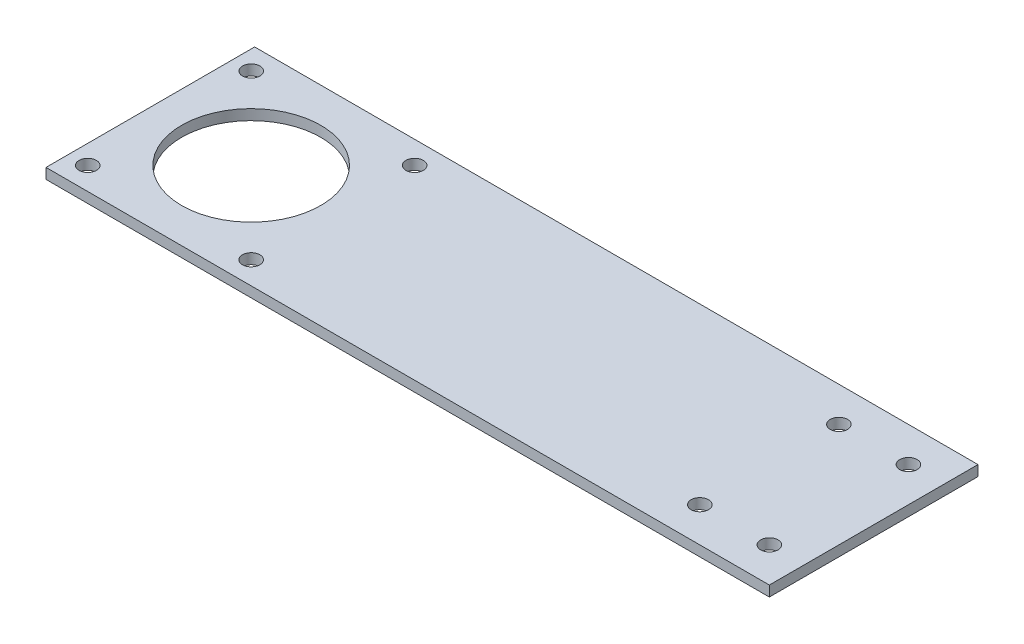
ISO-10303-21;
HEADER;
FILE_DESCRIPTION(('STEP AP214'),'2;1');
FILE_NAME('part.step','',(''),(''),'','','');
FILE_SCHEMA(('AUTOMOTIVE_DESIGN { 1 0 10303 214 1 1 1 1 }'));
ENDSEC;
DATA;
#1=APPLICATION_CONTEXT('core data for automotive mechanical design processes');
#2=APPLICATION_PROTOCOL_DEFINITION('international standard','automotive_design',2000,#1);
#3=PRODUCT_CONTEXT('',#1,'mechanical');
#4=PRODUCT('Part','Part','',(#3));
#5=PRODUCT_RELATED_PRODUCT_CATEGORY('part','',(#4));
#6=PRODUCT_DEFINITION_FORMATION('','',#4);
#7=PRODUCT_DEFINITION_CONTEXT('part definition',#1,'design');
#8=PRODUCT_DEFINITION('design','',#6,#7);
#9=PRODUCT_DEFINITION_SHAPE('','',#8);
#10=(LENGTH_UNIT() NAMED_UNIT(*) SI_UNIT(.MILLI.,.METRE.));
#11=(NAMED_UNIT(*) PLANE_ANGLE_UNIT() SI_UNIT($,.RADIAN.));
#12=(NAMED_UNIT(*) SI_UNIT($,.STERADIAN.) SOLID_ANGLE_UNIT());
#13=UNCERTAINTY_MEASURE_WITH_UNIT(LENGTH_MEASURE(1.E-05),#10,'distance_accuracy_value','');
#14=(GEOMETRIC_REPRESENTATION_CONTEXT(3) GLOBAL_UNCERTAINTY_ASSIGNED_CONTEXT((#13)) GLOBAL_UNIT_ASSIGNED_CONTEXT((#10,
#11,#12)) REPRESENTATION_CONTEXT('',''));
#15=CARTESIAN_POINT('',(0.,0.,0.));
#16=DIRECTION('',(0.,0.,1.));
#17=DIRECTION('',(1.,0.,0.));
#18=AXIS2_PLACEMENT_3D('',#15,#16,#17);
#19=CARTESIAN_POINT('',(0.,3.,0.));
#20=DIRECTION('',(0.,1.,0.));
#21=DIRECTION('',(0.,0.,1.));
#22=AXIS2_PLACEMENT_3D('',#19,#20,#21);
#23=PLANE('',#22);
#24=CARTESIAN_POINT('',(178.,3.,9.99999999999999));
#25=DIRECTION('',(0.,1.,0.));
#26=DIRECTION('',(0.,0.,-1.));
#27=AXIS2_PLACEMENT_3D('',#24,#25,#26);
#28=CIRCLE('',#27,2.5);
#29=CARTESIAN_POINT('',(178.,3.,7.5));
#30=VERTEX_POINT('',#29);
#31=EDGE_CURVE('E151',#30,#30,#28,.T.);
#32=ORIENTED_EDGE('',*,*,#31,.F.);
#33=EDGE_LOOP('',(#32));
#34=FACE_BOUND('',#33,.T.);
#35=CARTESIAN_POINT('',(178.,3.,50.));
#36=DIRECTION('',(0.,1.,0.));
#37=DIRECTION('',(0.,0.,1.));
#38=AXIS2_PLACEMENT_3D('',#35,#36,#37);
#39=CIRCLE('',#38,2.5);
#40=CARTESIAN_POINT('',(178.,3.,52.5));
#41=VERTEX_POINT('',#40);
#42=EDGE_CURVE('E139',#41,#41,#39,.T.);
#43=ORIENTED_EDGE('',*,*,#42,.F.);
#44=EDGE_LOOP('',(#43));
#45=FACE_BOUND('',#44,.T.);
#46=CARTESIAN_POINT('',(5.49999999999999,3.,53.5));
#47=DIRECTION('',(0.,1.,0.));
#48=DIRECTION('',(0.,0.,-1.));
#49=AXIS2_PLACEMENT_3D('',#46,#47,#48);
#50=CIRCLE('',#49,2.5);
#51=CARTESIAN_POINT('',(5.49999999999999,3.,51.));
#52=VERTEX_POINT('',#51);
#53=EDGE_CURVE('E127',#52,#52,#50,.T.);
#54=ORIENTED_EDGE('',*,*,#53,.F.);
#55=EDGE_LOOP('',(#54));
#56=FACE_BOUND('',#55,.T.);
#57=CARTESIAN_POINT('',(52.5,3.,6.50000000000001));
#58=DIRECTION('',(0.,1.,0.));
#59=DIRECTION('',(0.,0.,-1.));
#60=AXIS2_PLACEMENT_3D('',#57,#58,#59);
#61=CIRCLE('',#60,2.5);
#62=CARTESIAN_POINT('',(52.5,3.,4.));
#63=VERTEX_POINT('',#62);
#64=EDGE_CURVE('E115',#63,#63,#61,.T.);
#65=ORIENTED_EDGE('',*,*,#64,.F.);
#66=EDGE_LOOP('',(#65));
#67=FACE_BOUND('',#66,.T.);
#68=DIRECTION('',(0.,0.,1.));
#69=VECTOR('',#68,1.);
#70=CARTESIAN_POINT('',(0.,3.,0.));
#71=LINE('',#70,#69);
#72=CARTESIAN_POINT('',(0.,3.,0.));
#73=VERTEX_POINT('',#72);
#74=CARTESIAN_POINT('',(0.,3.,60.));
#75=VERTEX_POINT('',#74);
#76=EDGE_CURVE('E85',#73,#75,#71,.T.);
#77=ORIENTED_EDGE('',*,*,#76,.T.);
#78=DIRECTION('',(1.,0.,0.));
#79=VECTOR('',#78,1.);
#80=CARTESIAN_POINT('',(0.,3.,60.));
#81=LINE('',#80,#79);
#82=CARTESIAN_POINT('',(208.,3.,60.));
#83=VERTEX_POINT('',#82);
#84=EDGE_CURVE('E80',#75,#83,#81,.T.);
#85=ORIENTED_EDGE('',*,*,#84,.T.);
#86=DIRECTION('',(0.,0.,-1.));
#87=VECTOR('',#86,1.);
#88=CARTESIAN_POINT('',(208.,3.,0.));
#89=LINE('',#88,#87);
#90=CARTESIAN_POINT('',(208.,3.,0.));
#91=VERTEX_POINT('',#90);
#92=EDGE_CURVE('E83',#83,#91,#89,.T.);
#93=ORIENTED_EDGE('',*,*,#92,.T.);
#94=DIRECTION('',(-1.,0.,0.));
#95=VECTOR('',#94,1.);
#96=CARTESIAN_POINT('',(0.,3.,0.));
#97=LINE('',#96,#95);
#98=EDGE_CURVE('E50',#91,#73,#97,.T.);
#99=ORIENTED_EDGE('',*,*,#98,.T.);
#100=EDGE_LOOP('',(#77,#85,#93,#99));
#101=FACE_BOUND('',#100,.T.);
#102=CARTESIAN_POINT('',(5.5,3.,6.5));
#103=DIRECTION('',(0.,1.,0.));
#104=DIRECTION('',(0.,0.,1.));
#105=AXIS2_PLACEMENT_3D('',#102,#103,#104);
#106=CIRCLE('',#105,2.5);
#107=CARTESIAN_POINT('',(5.5,3.,9.));
#108=VERTEX_POINT('',#107);
#109=EDGE_CURVE('E100',#108,#108,#106,.T.);
#110=ORIENTED_EDGE('',*,*,#109,.F.);
#111=EDGE_LOOP('',(#110));
#112=FACE_BOUND('',#111,.T.);
#113=CARTESIAN_POINT('',(52.5,3.,53.5));
#114=DIRECTION('',(0.,1.,0.));
#115=DIRECTION('',(0.,0.,1.));
#116=AXIS2_PLACEMENT_3D('',#113,#114,#115);
#117=CIRCLE('',#116,2.5);
#118=CARTESIAN_POINT('',(52.5,3.,56.));
#119=VERTEX_POINT('',#118);
#120=EDGE_CURVE('E121',#119,#119,#117,.T.);
#121=ORIENTED_EDGE('',*,*,#120,.F.);
#122=EDGE_LOOP('',(#121));
#123=FACE_BOUND('',#122,.T.);
#124=CARTESIAN_POINT('',(29.,3.,30.));
#125=DIRECTION('',(0.,1.,0.));
#126=DIRECTION('',(0.,0.,1.));
#127=AXIS2_PLACEMENT_3D('',#124,#125,#126);
#128=CIRCLE('',#127,20.);
#129=CARTESIAN_POINT('',(29.,3.,50.));
#130=VERTEX_POINT('',#129);
#131=EDGE_CURVE('E133',#130,#130,#128,.T.);
#132=ORIENTED_EDGE('',*,*,#131,.F.);
#133=EDGE_LOOP('',(#132));
#134=FACE_BOUND('',#133,.T.);
#135=CARTESIAN_POINT('',(198.,3.,50.));
#136=DIRECTION('',(0.,1.,0.));
#137=DIRECTION('',(0.,0.,1.));
#138=AXIS2_PLACEMENT_3D('',#135,#136,#137);
#139=CIRCLE('',#138,2.5);
#140=CARTESIAN_POINT('',(198.,3.,52.5));
#141=VERTEX_POINT('',#140);
#142=EDGE_CURVE('E145',#141,#141,#139,.T.);
#143=ORIENTED_EDGE('',*,*,#142,.F.);
#144=EDGE_LOOP('',(#143));
#145=FACE_BOUND('',#144,.T.);
#146=CARTESIAN_POINT('',(198.,3.,9.99999999999999));
#147=DIRECTION('',(0.,1.,0.));
#148=DIRECTION('',(0.,0.,-1.));
#149=AXIS2_PLACEMENT_3D('',#146,#147,#148);
#150=CIRCLE('',#149,2.5);
#151=CARTESIAN_POINT('',(198.,3.,7.5));
#152=VERTEX_POINT('',#151);
#153=EDGE_CURVE('E157',#152,#152,#150,.T.);
#154=ORIENTED_EDGE('',*,*,#153,.F.);
#155=EDGE_LOOP('',(#154));
#156=FACE_BOUND('',#155,.T.);
#157=ADVANCED_FACE('F33',(#34,#45,#56,#67,#101,#112,#123,#134,#145,#156),#23,.T.);
#158=CARTESIAN_POINT('',(0.,0.,0.));
#159=DIRECTION('',(0.,1.,0.));
#160=DIRECTION('',(0.,0.,1.));
#161=AXIS2_PLACEMENT_3D('',#158,#159,#160);
#162=PLANE('',#161);
#163=CARTESIAN_POINT('',(178.,0.,9.99999999999999));
#164=DIRECTION('',(0.,1.,0.));
#165=DIRECTION('',(0.,0.,-1.));
#166=AXIS2_PLACEMENT_3D('',#163,#164,#165);
#167=CIRCLE('',#166,2.5);
#168=CARTESIAN_POINT('',(178.,0.,7.5));
#169=VERTEX_POINT('',#168);
#170=EDGE_CURVE('E154',#169,#169,#167,.T.);
#171=ORIENTED_EDGE('',*,*,#170,.T.);
#172=EDGE_LOOP('',(#171));
#173=FACE_BOUND('',#172,.T.);
#174=CARTESIAN_POINT('',(178.,0.,50.));
#175=DIRECTION('',(0.,1.,0.));
#176=DIRECTION('',(0.,0.,1.));
#177=AXIS2_PLACEMENT_3D('',#174,#175,#176);
#178=CIRCLE('',#177,2.5);
#179=CARTESIAN_POINT('',(178.,0.,52.5));
#180=VERTEX_POINT('',#179);
#181=EDGE_CURVE('E142',#180,#180,#178,.T.);
#182=ORIENTED_EDGE('',*,*,#181,.T.);
#183=EDGE_LOOP('',(#182));
#184=FACE_BOUND('',#183,.T.);
#185=CARTESIAN_POINT('',(5.49999999999999,0.,53.5));
#186=DIRECTION('',(0.,1.,0.));
#187=DIRECTION('',(0.,0.,-1.));
#188=AXIS2_PLACEMENT_3D('',#185,#186,#187);
#189=CIRCLE('',#188,2.5);
#190=CARTESIAN_POINT('',(5.49999999999999,0.,51.));
#191=VERTEX_POINT('',#190);
#192=EDGE_CURVE('E130',#191,#191,#189,.T.);
#193=ORIENTED_EDGE('',*,*,#192,.T.);
#194=EDGE_LOOP('',(#193));
#195=FACE_BOUND('',#194,.T.);
#196=CARTESIAN_POINT('',(52.5,0.,6.50000000000001));
#197=DIRECTION('',(0.,1.,0.));
#198=DIRECTION('',(0.,0.,-1.));
#199=AXIS2_PLACEMENT_3D('',#196,#197,#198);
#200=CIRCLE('',#199,2.5);
#201=CARTESIAN_POINT('',(52.5,0.,4.));
#202=VERTEX_POINT('',#201);
#203=EDGE_CURVE('E118',#202,#202,#200,.T.);
#204=ORIENTED_EDGE('',*,*,#203,.T.);
#205=EDGE_LOOP('',(#204));
#206=FACE_BOUND('',#205,.T.);
#207=DIRECTION('',(0.,0.,1.));
#208=VECTOR('',#207,1.);
#209=CARTESIAN_POINT('',(0.,0.,0.));
#210=LINE('',#209,#208);
#211=CARTESIAN_POINT('',(0.,0.,0.));
#212=VERTEX_POINT('',#211);
#213=CARTESIAN_POINT('',(0.,0.,60.));
#214=VERTEX_POINT('',#213);
#215=EDGE_CURVE('E97',#212,#214,#210,.T.);
#216=ORIENTED_EDGE('',*,*,#215,.F.);
#217=DIRECTION('',(-1.,0.,0.));
#218=VECTOR('',#217,1.);
#219=CARTESIAN_POINT('',(0.,0.,0.));
#220=LINE('',#219,#218);
#221=CARTESIAN_POINT('',(208.,0.,0.));
#222=VERTEX_POINT('',#221);
#223=EDGE_CURVE('E73',#222,#212,#220,.T.);
#224=ORIENTED_EDGE('',*,*,#223,.F.);
#225=DIRECTION('',(0.,0.,-1.));
#226=VECTOR('',#225,1.);
#227=CARTESIAN_POINT('',(208.,0.,0.));
#228=LINE('',#227,#226);
#229=CARTESIAN_POINT('',(208.,0.,60.));
#230=VERTEX_POINT('',#229);
#231=EDGE_CURVE('E67',#230,#222,#228,.T.);
#232=ORIENTED_EDGE('',*,*,#231,.F.);
#233=DIRECTION('',(1.,0.,0.));
#234=VECTOR('',#233,1.);
#235=CARTESIAN_POINT('',(0.,0.,60.));
#236=LINE('',#235,#234);
#237=EDGE_CURVE('E89',#214,#230,#236,.T.);
#238=ORIENTED_EDGE('',*,*,#237,.F.);
#239=EDGE_LOOP('',(#216,#224,#232,#238));
#240=FACE_BOUND('',#239,.T.);
#241=CARTESIAN_POINT('',(5.5,0.,6.5));
#242=DIRECTION('',(0.,1.,0.));
#243=DIRECTION('',(0.,0.,1.));
#244=AXIS2_PLACEMENT_3D('',#241,#242,#243);
#245=CIRCLE('',#244,2.5);
#246=CARTESIAN_POINT('',(5.5,0.,9.));
#247=VERTEX_POINT('',#246);
#248=EDGE_CURVE('E112',#247,#247,#245,.T.);
#249=ORIENTED_EDGE('',*,*,#248,.T.);
#250=EDGE_LOOP('',(#249));
#251=FACE_BOUND('',#250,.T.);
#252=CARTESIAN_POINT('',(52.5,0.,53.5));
#253=DIRECTION('',(0.,1.,0.));
#254=DIRECTION('',(0.,0.,1.));
#255=AXIS2_PLACEMENT_3D('',#252,#253,#254);
#256=CIRCLE('',#255,2.5);
#257=CARTESIAN_POINT('',(52.5,0.,56.));
#258=VERTEX_POINT('',#257);
#259=EDGE_CURVE('E124',#258,#258,#256,.T.);
#260=ORIENTED_EDGE('',*,*,#259,.T.);
#261=EDGE_LOOP('',(#260));
#262=FACE_BOUND('',#261,.T.);
#263=CARTESIAN_POINT('',(29.,0.,30.));
#264=DIRECTION('',(0.,1.,0.));
#265=DIRECTION('',(0.,0.,1.));
#266=AXIS2_PLACEMENT_3D('',#263,#264,#265);
#267=CIRCLE('',#266,20.);
#268=CARTESIAN_POINT('',(29.,0.,50.));
#269=VERTEX_POINT('',#268);
#270=EDGE_CURVE('E136',#269,#269,#267,.T.);
#271=ORIENTED_EDGE('',*,*,#270,.T.);
#272=EDGE_LOOP('',(#271));
#273=FACE_BOUND('',#272,.T.);
#274=CARTESIAN_POINT('',(198.,0.,50.));
#275=DIRECTION('',(0.,1.,0.));
#276=DIRECTION('',(0.,0.,1.));
#277=AXIS2_PLACEMENT_3D('',#274,#275,#276);
#278=CIRCLE('',#277,2.5);
#279=CARTESIAN_POINT('',(198.,0.,52.5));
#280=VERTEX_POINT('',#279);
#281=EDGE_CURVE('E148',#280,#280,#278,.T.);
#282=ORIENTED_EDGE('',*,*,#281,.T.);
#283=EDGE_LOOP('',(#282));
#284=FACE_BOUND('',#283,.T.);
#285=CARTESIAN_POINT('',(198.,0.,9.99999999999999));
#286=DIRECTION('',(0.,1.,0.));
#287=DIRECTION('',(0.,0.,-1.));
#288=AXIS2_PLACEMENT_3D('',#285,#286,#287);
#289=CIRCLE('',#288,2.5);
#290=CARTESIAN_POINT('',(198.,0.,7.5));
#291=VERTEX_POINT('',#290);
#292=EDGE_CURVE('E160',#291,#291,#289,.T.);
#293=ORIENTED_EDGE('',*,*,#292,.T.);
#294=EDGE_LOOP('',(#293));
#295=FACE_BOUND('',#294,.T.);
#296=ADVANCED_FACE('F108',(#173,#184,#195,#206,#240,#251,#262,#273,#284,#295),#162,.F.);
#297=CARTESIAN_POINT('',(0.,3.,0.));
#298=DIRECTION('',(1.,0.,0.));
#299=DIRECTION('',(0.,0.,-1.));
#300=AXIS2_PLACEMENT_3D('',#297,#298,#299);
#301=PLANE('',#300);
#302=ORIENTED_EDGE('',*,*,#215,.T.);
#303=DIRECTION('',(0.,-1.,0.));
#304=VECTOR('',#303,1.);
#305=CARTESIAN_POINT('',(0.,3.,60.));
#306=LINE('',#305,#304);
#307=EDGE_CURVE('E11',#75,#214,#306,.T.);
#308=ORIENTED_EDGE('',*,*,#307,.F.);
#309=ORIENTED_EDGE('',*,*,#76,.F.);
#310=DIRECTION('',(0.,-1.,0.));
#311=VECTOR('',#310,1.);
#312=CARTESIAN_POINT('',(0.,3.,0.));
#313=LINE('',#312,#311);
#314=EDGE_CURVE('E93',#73,#212,#313,.T.);
#315=ORIENTED_EDGE('',*,*,#314,.T.);
#316=EDGE_LOOP('',(#302,#308,#309,#315));
#317=FACE_BOUND('',#316,.T.);
#318=ADVANCED_FACE('F35',(#317),#301,.F.);
#319=CARTESIAN_POINT('',(0.,3.,60.));
#320=DIRECTION('',(0.,0.,-1.));
#321=DIRECTION('',(-1.,0.,0.));
#322=AXIS2_PLACEMENT_3D('',#319,#320,#321);
#323=PLANE('',#322);
#324=ORIENTED_EDGE('',*,*,#237,.T.);
#325=DIRECTION('',(0.,-1.,0.));
#326=VECTOR('',#325,1.);
#327=CARTESIAN_POINT('',(208.,3.,60.));
#328=LINE('',#327,#326);
#329=EDGE_CURVE('E42',#83,#230,#328,.T.);
#330=ORIENTED_EDGE('',*,*,#329,.F.);
#331=ORIENTED_EDGE('',*,*,#84,.F.);
#332=ORIENTED_EDGE('',*,*,#307,.T.);
#333=EDGE_LOOP('',(#324,#330,#331,#332));
#334=FACE_BOUND('',#333,.T.);
#335=ADVANCED_FACE('F88',(#334),#323,.F.);
#336=CARTESIAN_POINT('',(208.,3.,0.));
#337=DIRECTION('',(-1.,0.,0.));
#338=DIRECTION('',(0.,0.,1.));
#339=AXIS2_PLACEMENT_3D('',#336,#337,#338);
#340=PLANE('',#339);
#341=ORIENTED_EDGE('',*,*,#231,.T.);
#342=DIRECTION('',(0.,-1.,0.));
#343=VECTOR('',#342,1.);
#344=CARTESIAN_POINT('',(208.,3.,0.));
#345=LINE('',#344,#343);
#346=EDGE_CURVE('E90',#91,#222,#345,.T.);
#347=ORIENTED_EDGE('',*,*,#346,.F.);
#348=ORIENTED_EDGE('',*,*,#92,.F.);
#349=ORIENTED_EDGE('',*,*,#329,.T.);
#350=EDGE_LOOP('',(#341,#347,#348,#349));
#351=FACE_BOUND('',#350,.T.);
#352=ADVANCED_FACE('F91',(#351),#340,.F.);
#353=CARTESIAN_POINT('',(0.,3.,0.));
#354=DIRECTION('',(0.,0.,1.));
#355=DIRECTION('',(1.,0.,0.));
#356=AXIS2_PLACEMENT_3D('',#353,#354,#355);
#357=PLANE('',#356);
#358=ORIENTED_EDGE('',*,*,#223,.T.);
#359=ORIENTED_EDGE('',*,*,#314,.F.);
#360=ORIENTED_EDGE('',*,*,#98,.F.);
#361=ORIENTED_EDGE('',*,*,#346,.T.);
#362=EDGE_LOOP('',(#358,#359,#360,#361));
#363=FACE_BOUND('',#362,.T.);
#364=ADVANCED_FACE('F105',(#363),#357,.F.);
#365=CARTESIAN_POINT('',(5.5,3.,6.5));
#366=DIRECTION('',(0.,-1.,0.));
#367=DIRECTION('',(0.,0.,-1.));
#368=AXIS2_PLACEMENT_3D('',#365,#366,#367);
#369=CYLINDRICAL_SURFACE('',#368,2.5);
#370=ORIENTED_EDGE('',*,*,#109,.T.);
#371=EDGE_LOOP('',(#370));
#372=FACE_BOUND('',#371,.T.);
#373=ORIENTED_EDGE('',*,*,#248,.F.);
#374=EDGE_LOOP('',(#373));
#375=FACE_BOUND('',#374,.T.);
#376=ADVANCED_FACE('F180',(#372,#375),#369,.F.);
#377=CARTESIAN_POINT('',(52.5,3.,6.50000000000001));
#378=DIRECTION('',(0.,-1.,0.));
#379=DIRECTION('',(0.,0.,-1.));
#380=AXIS2_PLACEMENT_3D('',#377,#378,#379);
#381=CYLINDRICAL_SURFACE('',#380,2.5);
#382=ORIENTED_EDGE('',*,*,#64,.T.);
#383=EDGE_LOOP('',(#382));
#384=FACE_BOUND('',#383,.T.);
#385=ORIENTED_EDGE('',*,*,#203,.F.);
#386=EDGE_LOOP('',(#385));
#387=FACE_BOUND('',#386,.T.);
#388=ADVANCED_FACE('F226',(#384,#387),#381,.F.);
#389=CARTESIAN_POINT('',(52.5,3.,53.5));
#390=DIRECTION('',(0.,-1.,0.));
#391=DIRECTION('',(0.,0.,-1.));
#392=AXIS2_PLACEMENT_3D('',#389,#390,#391);
#393=CYLINDRICAL_SURFACE('',#392,2.5);
#394=ORIENTED_EDGE('',*,*,#120,.T.);
#395=EDGE_LOOP('',(#394));
#396=FACE_BOUND('',#395,.T.);
#397=ORIENTED_EDGE('',*,*,#259,.F.);
#398=EDGE_LOOP('',(#397));
#399=FACE_BOUND('',#398,.T.);
#400=ADVANCED_FACE('F234',(#396,#399),#393,.F.);
#401=CARTESIAN_POINT('',(5.49999999999999,3.,53.5));
#402=DIRECTION('',(0.,-1.,0.));
#403=DIRECTION('',(0.,0.,-1.));
#404=AXIS2_PLACEMENT_3D('',#401,#402,#403);
#405=CYLINDRICAL_SURFACE('',#404,2.5);
#406=ORIENTED_EDGE('',*,*,#53,.T.);
#407=EDGE_LOOP('',(#406));
#408=FACE_BOUND('',#407,.T.);
#409=ORIENTED_EDGE('',*,*,#192,.F.);
#410=EDGE_LOOP('',(#409));
#411=FACE_BOUND('',#410,.T.);
#412=ADVANCED_FACE('F242',(#408,#411),#405,.F.);
#413=CARTESIAN_POINT('',(29.,3.,30.));
#414=DIRECTION('',(0.,-1.,0.));
#415=DIRECTION('',(0.,0.,-1.));
#416=AXIS2_PLACEMENT_3D('',#413,#414,#415);
#417=CYLINDRICAL_SURFACE('',#416,20.);
#418=ORIENTED_EDGE('',*,*,#131,.T.);
#419=EDGE_LOOP('',(#418));
#420=FACE_BOUND('',#419,.T.);
#421=ORIENTED_EDGE('',*,*,#270,.F.);
#422=EDGE_LOOP('',(#421));
#423=FACE_BOUND('',#422,.T.);
#424=ADVANCED_FACE('F251',(#420,#423),#417,.F.);
#425=CARTESIAN_POINT('',(178.,3.,50.));
#426=DIRECTION('',(0.,-1.,0.));
#427=DIRECTION('',(0.,0.,-1.));
#428=AXIS2_PLACEMENT_3D('',#425,#426,#427);
#429=CYLINDRICAL_SURFACE('',#428,2.5);
#430=ORIENTED_EDGE('',*,*,#42,.T.);
#431=EDGE_LOOP('',(#430));
#432=FACE_BOUND('',#431,.T.);
#433=ORIENTED_EDGE('',*,*,#181,.F.);
#434=EDGE_LOOP('',(#433));
#435=FACE_BOUND('',#434,.T.);
#436=ADVANCED_FACE('F260',(#432,#435),#429,.F.);
#437=CARTESIAN_POINT('',(198.,3.,50.));
#438=DIRECTION('',(0.,-1.,0.));
#439=DIRECTION('',(0.,0.,-1.));
#440=AXIS2_PLACEMENT_3D('',#437,#438,#439);
#441=CYLINDRICAL_SURFACE('',#440,2.5);
#442=ORIENTED_EDGE('',*,*,#142,.T.);
#443=EDGE_LOOP('',(#442));
#444=FACE_BOUND('',#443,.T.);
#445=ORIENTED_EDGE('',*,*,#281,.F.);
#446=EDGE_LOOP('',(#445));
#447=FACE_BOUND('',#446,.T.);
#448=ADVANCED_FACE('F269',(#444,#447),#441,.F.);
#449=CARTESIAN_POINT('',(178.,3.,9.99999999999999));
#450=DIRECTION('',(0.,-1.,0.));
#451=DIRECTION('',(0.,0.,-1.));
#452=AXIS2_PLACEMENT_3D('',#449,#450,#451);
#453=CYLINDRICAL_SURFACE('',#452,2.5);
#454=ORIENTED_EDGE('',*,*,#31,.T.);
#455=EDGE_LOOP('',(#454));
#456=FACE_BOUND('',#455,.T.);
#457=ORIENTED_EDGE('',*,*,#170,.F.);
#458=EDGE_LOOP('',(#457));
#459=FACE_BOUND('',#458,.T.);
#460=ADVANCED_FACE('F278',(#456,#459),#453,.F.);
#461=CARTESIAN_POINT('',(198.,3.,9.99999999999999));
#462=DIRECTION('',(0.,-1.,0.));
#463=DIRECTION('',(0.,0.,-1.));
#464=AXIS2_PLACEMENT_3D('',#461,#462,#463);
#465=CYLINDRICAL_SURFACE('',#464,2.5);
#466=ORIENTED_EDGE('',*,*,#153,.T.);
#467=EDGE_LOOP('',(#466));
#468=FACE_BOUND('',#467,.T.);
#469=ORIENTED_EDGE('',*,*,#292,.F.);
#470=EDGE_LOOP('',(#469));
#471=FACE_BOUND('',#470,.T.);
#472=ADVANCED_FACE('F166',(#468,#471),#465,.F.);
#473=CLOSED_SHELL('',(#157,#296,#318,#335,#352,#364,#376,#388,#400,#412,#424,#436,#448,#460,#472));
#474=MANIFOLD_SOLID_BREP('B2',#473);
#475=ADVANCED_BREP_SHAPE_REPRESENTATION('',(#18,#474),#14);
#476=SHAPE_DEFINITION_REPRESENTATION(#9,#475);
ENDSEC;
END-ISO-10303-21;
